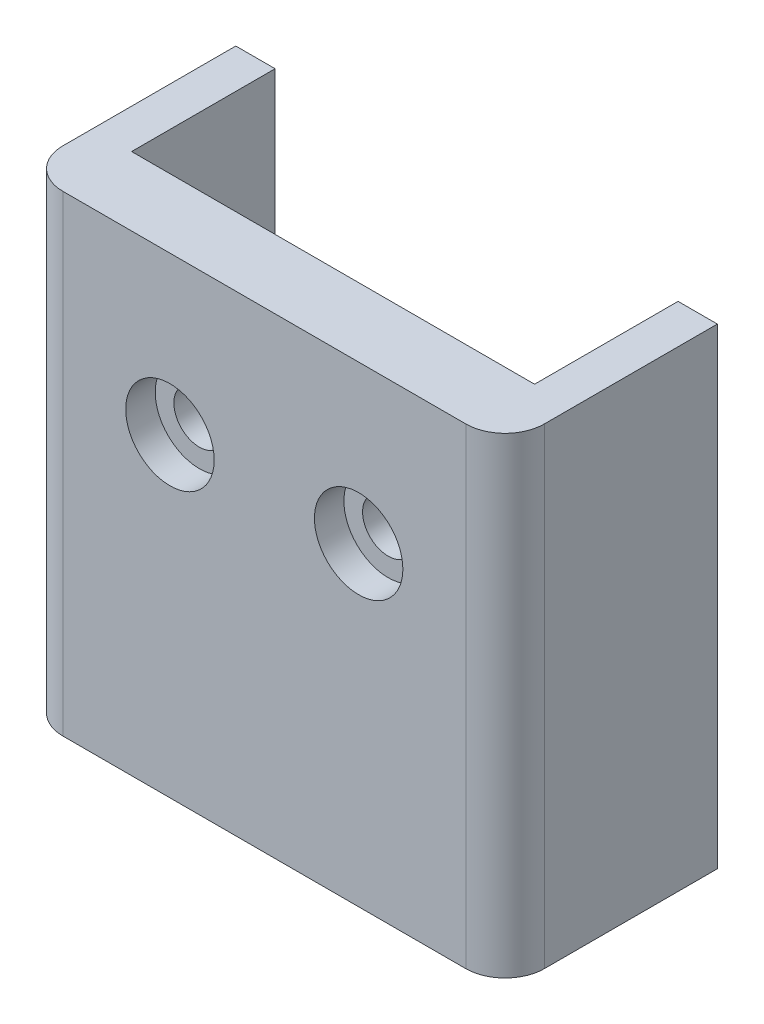
ISO-10303-21;
HEADER;
FILE_DESCRIPTION(('STEP AP214'),'2;1');
FILE_NAME('part.step','',(''),(''),'','','');
FILE_SCHEMA(('AUTOMOTIVE_DESIGN { 1 0 10303 214 1 1 1 1 }'));
ENDSEC;
DATA;
#1=APPLICATION_CONTEXT('core data for automotive mechanical design processes');
#2=APPLICATION_PROTOCOL_DEFINITION('international standard','automotive_design',2000,#1);
#3=PRODUCT_CONTEXT('',#1,'mechanical');
#4=PRODUCT('Part','Part','',(#3));
#5=PRODUCT_RELATED_PRODUCT_CATEGORY('part','',(#4));
#6=PRODUCT_DEFINITION_FORMATION('','',#4);
#7=PRODUCT_DEFINITION_CONTEXT('part definition',#1,'design');
#8=PRODUCT_DEFINITION('design','',#6,#7);
#9=PRODUCT_DEFINITION_SHAPE('','',#8);
#10=(LENGTH_UNIT() NAMED_UNIT(*) SI_UNIT(.MILLI.,.METRE.));
#11=(NAMED_UNIT(*) PLANE_ANGLE_UNIT() SI_UNIT($,.RADIAN.));
#12=(NAMED_UNIT(*) SI_UNIT($,.STERADIAN.) SOLID_ANGLE_UNIT());
#13=UNCERTAINTY_MEASURE_WITH_UNIT(LENGTH_MEASURE(1.E-05),#10,'distance_accuracy_value','');
#14=(GEOMETRIC_REPRESENTATION_CONTEXT(3) GLOBAL_UNCERTAINTY_ASSIGNED_CONTEXT((#13)) GLOBAL_UNIT_ASSIGNED_CONTEXT((#10,
#11,#12)) REPRESENTATION_CONTEXT('',''));
#15=CARTESIAN_POINT('',(0.,0.,0.));
#16=DIRECTION('',(0.,0.,1.));
#17=DIRECTION('',(1.,0.,0.));
#18=AXIS2_PLACEMENT_3D('',#15,#16,#17);
#19=CARTESIAN_POINT('',(0.,0.,0.));
#20=DIRECTION('',(0.,0.,1.));
#21=DIRECTION('',(1.,0.,0.));
#22=AXIS2_PLACEMENT_3D('',#19,#20,#21);
#23=PLANE('',#22);
#24=CARTESIAN_POINT('',(4.8,5.,0.));
#25=DIRECTION('',(0.,0.,1.));
#26=DIRECTION('',(1.,0.,0.));
#27=AXIS2_PLACEMENT_3D('',#24,#25,#26);
#28=CIRCLE('',#27,1.3);
#29=CARTESIAN_POINT('',(6.1,5.,0.));
#30=VERTEX_POINT('',#29);
#31=EDGE_CURVE('E277',#30,#30,#28,.T.);
#32=ORIENTED_EDGE('',*,*,#31,.T.);
#33=EDGE_LOOP('',(#32));
#34=FACE_BOUND('',#33,.T.);
#35=CARTESIAN_POINT('',(-4.8,5.,0.));
#36=DIRECTION('',(0.,0.,1.));
#37=DIRECTION('',(1.,0.,0.));
#38=AXIS2_PLACEMENT_3D('',#35,#36,#37);
#39=CIRCLE('',#38,1.3);
#40=CARTESIAN_POINT('',(-3.5,5.,0.));
#41=VERTEX_POINT('',#40);
#42=EDGE_CURVE('E282',#41,#41,#39,.T.);
#43=ORIENTED_EDGE('',*,*,#42,.T.);
#44=EDGE_LOOP('',(#43));
#45=FACE_BOUND('',#44,.T.);
#46=DIRECTION('',(0.,1.,0.));
#47=VECTOR('',#46,1.);
#48=CARTESIAN_POINT('',(10.25,13.,0.));
#49=LINE('',#48,#47);
#50=CARTESIAN_POINT('',(10.25,-9.,0.));
#51=VERTEX_POINT('',#50);
#52=CARTESIAN_POINT('',(10.25,13.,0.));
#53=VERTEX_POINT('',#52);
#54=EDGE_CURVE('E296',#51,#53,#49,.T.);
#55=ORIENTED_EDGE('',*,*,#54,.F.);
#56=DIRECTION('',(-1.,0.,0.));
#57=VECTOR('',#56,1.);
#58=CARTESIAN_POINT('',(-10.25,-9.,0.));
#59=LINE('',#58,#57);
#60=CARTESIAN_POINT('',(-10.25,-9.,0.));
#61=VERTEX_POINT('',#60);
#62=EDGE_CURVE('E260',#51,#61,#59,.T.);
#63=ORIENTED_EDGE('',*,*,#62,.T.);
#64=DIRECTION('',(0.,-1.,0.));
#65=VECTOR('',#64,1.);
#66=CARTESIAN_POINT('',(-10.25,13.,0.));
#67=LINE('',#66,#65);
#68=CARTESIAN_POINT('',(-10.25,13.,0.));
#69=VERTEX_POINT('',#68);
#70=EDGE_CURVE('E285',#69,#61,#67,.T.);
#71=ORIENTED_EDGE('',*,*,#70,.F.);
#72=DIRECTION('',(-1.,0.,0.));
#73=VECTOR('',#72,1.);
#74=CARTESIAN_POINT('',(-10.25,13.,0.));
#75=LINE('',#74,#73);
#76=EDGE_CURVE('E290',#53,#69,#75,.T.);
#77=ORIENTED_EDGE('',*,*,#76,.F.);
#78=EDGE_LOOP('',(#55,#63,#71,#77));
#79=FACE_BOUND('',#78,.T.);
#80=ADVANCED_FACE('F32',(#34,#45,#79),#23,.F.);
#81=CARTESIAN_POINT('',(-4.8,5.,3.5));
#82=DIRECTION('',(0.,0.,-1.));
#83=DIRECTION('',(-1.,0.,0.));
#84=AXIS2_PLACEMENT_3D('',#81,#82,#83);
#85=CYLINDRICAL_SURFACE('',#84,1.3);
#86=ORIENTED_EDGE('',*,*,#42,.F.);
#87=EDGE_LOOP('',(#86));
#88=FACE_BOUND('',#87,.T.);
#89=CARTESIAN_POINT('',(-4.8,5.,2.));
#90=DIRECTION('',(0.,0.,1.));
#91=DIRECTION('',(1.,0.,0.));
#92=AXIS2_PLACEMENT_3D('',#89,#90,#91);
#93=CIRCLE('',#92,1.3);
#94=CARTESIAN_POINT('',(-3.5,5.,2.));
#95=VERTEX_POINT('',#94);
#96=EDGE_CURVE('E253',#95,#95,#93,.T.);
#97=ORIENTED_EDGE('',*,*,#96,.T.);
#98=EDGE_LOOP('',(#97));
#99=FACE_BOUND('',#98,.T.);
#100=ADVANCED_FACE('F335',(#88,#99),#85,.F.);
#101=CARTESIAN_POINT('',(4.8,5.,3.5));
#102=DIRECTION('',(0.,0.,-1.));
#103=DIRECTION('',(-1.,0.,0.));
#104=AXIS2_PLACEMENT_3D('',#101,#102,#103);
#105=CYLINDRICAL_SURFACE('',#104,1.3);
#106=ORIENTED_EDGE('',*,*,#31,.F.);
#107=EDGE_LOOP('',(#106));
#108=FACE_BOUND('',#107,.T.);
#109=CARTESIAN_POINT('',(4.8,5.,2.));
#110=DIRECTION('',(0.,0.,1.));
#111=DIRECTION('',(1.,0.,0.));
#112=AXIS2_PLACEMENT_3D('',#109,#110,#111);
#113=CIRCLE('',#112,1.3);
#114=CARTESIAN_POINT('',(6.1,5.,2.));
#115=VERTEX_POINT('',#114);
#116=EDGE_CURVE('E234',#115,#115,#113,.T.);
#117=ORIENTED_EDGE('',*,*,#116,.T.);
#118=EDGE_LOOP('',(#117));
#119=FACE_BOUND('',#118,.T.);
#120=ADVANCED_FACE('F355',(#108,#119),#105,.F.);
#121=CARTESIAN_POINT('',(0.,0.,3.5));
#122=DIRECTION('',(0.,0.,1.));
#123=DIRECTION('',(1.,0.,0.));
#124=AXIS2_PLACEMENT_3D('',#121,#122,#123);
#125=PLANE('',#124);
#126=CARTESIAN_POINT('',(-4.8,5.,3.5));
#127=DIRECTION('',(0.,0.,1.));
#128=DIRECTION('',(1.,0.,0.));
#129=AXIS2_PLACEMENT_3D('',#126,#127,#128);
#130=CIRCLE('',#129,2.25);
#131=CARTESIAN_POINT('',(-2.55,5.,3.5));
#132=VERTEX_POINT('',#131);
#133=EDGE_CURVE('E235',#132,#132,#130,.T.);
#134=ORIENTED_EDGE('',*,*,#133,.F.);
#135=EDGE_LOOP('',(#134));
#136=FACE_BOUND('',#135,.T.);
#137=CARTESIAN_POINT('',(4.8,5.,3.5));
#138=DIRECTION('',(0.,0.,1.));
#139=DIRECTION('',(1.,0.,0.));
#140=AXIS2_PLACEMENT_3D('',#137,#138,#139);
#141=CIRCLE('',#140,2.25);
#142=CARTESIAN_POINT('',(7.05,5.,3.5));
#143=VERTEX_POINT('',#142);
#144=EDGE_CURVE('E230',#143,#143,#141,.T.);
#145=ORIENTED_EDGE('',*,*,#144,.F.);
#146=EDGE_LOOP('',(#145));
#147=FACE_BOUND('',#146,.T.);
#148=DIRECTION('',(-1.,0.,0.));
#149=VECTOR('',#148,1.);
#150=CARTESIAN_POINT('',(-10.25,13.,3.5));
#151=LINE('',#150,#149);
#152=CARTESIAN_POINT('',(10.25,13.,3.5));
#153=VERTEX_POINT('',#152);
#154=CARTESIAN_POINT('',(-10.25,13.,3.5));
#155=VERTEX_POINT('',#154);
#156=EDGE_CURVE('E289',#153,#155,#151,.T.);
#157=ORIENTED_EDGE('',*,*,#156,.T.);
#158=DIRECTION('',(0.,-1.,0.));
#159=VECTOR('',#158,1.);
#160=CARTESIAN_POINT('',(-10.25,0.,3.5));
#161=LINE('',#160,#159);
#162=CARTESIAN_POINT('',(-10.25,-11.,3.5));
#163=VERTEX_POINT('',#162);
#164=EDGE_CURVE('E315',#155,#163,#161,.T.);
#165=ORIENTED_EDGE('',*,*,#164,.T.);
#166=DIRECTION('',(1.,0.,0.));
#167=VECTOR('',#166,1.);
#168=CARTESIAN_POINT('',(-10.25,-11.,3.5));
#169=LINE('',#168,#167);
#170=CARTESIAN_POINT('',(10.25,-11.,3.5));
#171=VERTEX_POINT('',#170);
#172=EDGE_CURVE('E286',#163,#171,#169,.T.);
#173=ORIENTED_EDGE('',*,*,#172,.T.);
#174=DIRECTION('',(0.,-1.,0.));
#175=VECTOR('',#174,1.);
#176=CARTESIAN_POINT('',(10.25,0.,3.5));
#177=LINE('',#176,#175);
#178=EDGE_CURVE('E313',#171,#153,#177,.F.);
#179=ORIENTED_EDGE('',*,*,#178,.T.);
#180=EDGE_LOOP('',(#157,#165,#173,#179));
#181=FACE_BOUND('',#180,.T.);
#182=ADVANCED_FACE('F351',(#136,#147,#181),#125,.T.);
#183=CARTESIAN_POINT('',(-10.25,-11.,3.5));
#184=DIRECTION('',(0.,1.,0.));
#185=DIRECTION('',(-1.,0.,0.));
#186=AXIS2_PLACEMENT_3D('',#183,#184,#185);
#187=PLANE('',#186);
#188=CARTESIAN_POINT('',(0.,-11.,-3.50329288344196));
#189=DIRECTION('',(0.,-1.,0.));
#190=DIRECTION('',(-1.,0.,0.));
#191=AXIS2_PLACEMENT_3D('',#188,#189,#190);
#192=CIRCLE('',#191,3.74990044459615);
#193=CARTESIAN_POINT('',(3.74639242810852,-11.,-3.34112901880652));
#194=VERTEX_POINT('',#193);
#195=CARTESIAN_POINT('',(-3.74639242810852,-11.,-3.34112901880652));
#196=VERTEX_POINT('',#195);
#197=EDGE_CURVE('E188',#194,#196,#192,.T.);
#198=ORIENTED_EDGE('',*,*,#197,.F.);
#199=CARTESIAN_POINT('',(0.25,-11.,-3.5));
#200=DIRECTION('',(0.,1.,0.));
#201=DIRECTION('',(-1.,0.,0.));
#202=AXIS2_PLACEMENT_3D('',#199,#200,#201);
#203=CIRCLE('',#202,3.5);
#204=CARTESIAN_POINT('',(3.75,-11.,-3.5));
#205=VERTEX_POINT('',#204);
#206=EDGE_CURVE('E304',#194,#205,#203,.T.);
#207=ORIENTED_EDGE('',*,*,#206,.T.);
#208=DIRECTION('',(0.,0.,-1.));
#209=VECTOR('',#208,1.);
#210=CARTESIAN_POINT('',(3.75,-11.,0.));
#211=LINE('',#210,#209);
#212=CARTESIAN_POINT('',(3.75,-11.,-7.3));
#213=VERTEX_POINT('',#212);
#214=EDGE_CURVE('E247',#205,#213,#211,.T.);
#215=ORIENTED_EDGE('',*,*,#214,.T.);
#216=DIRECTION('',(1.,0.,0.));
#217=VECTOR('',#216,1.);
#218=CARTESIAN_POINT('',(12.25,-11.,-7.3));
#219=LINE('',#218,#217);
#220=CARTESIAN_POINT('',(12.25,-11.,-7.3));
#221=VERTEX_POINT('',#220);
#222=EDGE_CURVE('E215',#213,#221,#219,.T.);
#223=ORIENTED_EDGE('',*,*,#222,.T.);
#224=DIRECTION('',(0.,0.,1.));
#225=VECTOR('',#224,1.);
#226=CARTESIAN_POINT('',(12.25,-11.,3.5));
#227=LINE('',#226,#225);
#228=CARTESIAN_POINT('',(12.25,-11.,1.5));
#229=VERTEX_POINT('',#228);
#230=EDGE_CURVE('E263',#221,#229,#227,.T.);
#231=ORIENTED_EDGE('',*,*,#230,.T.);
#232=CARTESIAN_POINT('',(10.25,-11.,1.5));
#233=DIRECTION('',(0.,1.,0.));
#234=DIRECTION('',(-1.,0.,0.));
#235=AXIS2_PLACEMENT_3D('',#232,#233,#234);
#236=CIRCLE('',#235,2.);
#237=EDGE_CURVE('E318',#229,#171,#236,.F.);
#238=ORIENTED_EDGE('',*,*,#237,.T.);
#239=ORIENTED_EDGE('',*,*,#172,.F.);
#240=CARTESIAN_POINT('',(-10.25,-11.,1.5));
#241=DIRECTION('',(0.,1.,0.));
#242=DIRECTION('',(-1.,0.,0.));
#243=AXIS2_PLACEMENT_3D('',#240,#241,#242);
#244=CIRCLE('',#243,2.);
#245=CARTESIAN_POINT('',(-12.25,-11.,1.5));
#246=VERTEX_POINT('',#245);
#247=EDGE_CURVE('E320',#163,#246,#244,.F.);
#248=ORIENTED_EDGE('',*,*,#247,.T.);
#249=DIRECTION('',(0.,0.,-1.));
#250=VECTOR('',#249,1.);
#251=CARTESIAN_POINT('',(-12.25,-11.,3.5));
#252=LINE('',#251,#250);
#253=CARTESIAN_POINT('',(-12.25,-11.,-7.3));
#254=VERTEX_POINT('',#253);
#255=EDGE_CURVE('E270',#246,#254,#252,.T.);
#256=ORIENTED_EDGE('',*,*,#255,.T.);
#257=CARTESIAN_POINT('',(-3.75,-11.,-7.3));
#258=VERTEX_POINT('',#257);
#259=EDGE_CURVE('E211',#254,#258,#219,.T.);
#260=ORIENTED_EDGE('',*,*,#259,.T.);
#261=DIRECTION('',(0.,0.,1.));
#262=VECTOR('',#261,1.);
#263=CARTESIAN_POINT('',(-3.75,-11.,0.));
#264=LINE('',#263,#262);
#265=CARTESIAN_POINT('',(-3.75,-11.,-3.5));
#266=VERTEX_POINT('',#265);
#267=EDGE_CURVE('E250',#258,#266,#264,.T.);
#268=ORIENTED_EDGE('',*,*,#267,.T.);
#269=CARTESIAN_POINT('',(-0.249999999999997,-11.,-3.5));
#270=DIRECTION('',(0.,1.,0.));
#271=DIRECTION('',(-1.,0.,0.));
#272=AXIS2_PLACEMENT_3D('',#269,#270,#271);
#273=CIRCLE('',#272,3.5);
#274=EDGE_CURVE('E309',#266,#196,#273,.T.);
#275=ORIENTED_EDGE('',*,*,#274,.T.);
#276=EDGE_LOOP('',(#198,#207,#215,#223,#231,#238,#239,#248,#256,#260,#268,#275));
#277=FACE_BOUND('',#276,.T.);
#278=ADVANCED_FACE('F354',(#277),#187,.F.);
#279=CARTESIAN_POINT('',(-10.25,13.,3.5));
#280=DIRECTION('',(0.,-1.,0.));
#281=DIRECTION('',(0.,0.,-1.));
#282=AXIS2_PLACEMENT_3D('',#279,#280,#281);
#283=PLANE('',#282);
#284=DIRECTION('',(0.,0.,1.));
#285=VECTOR('',#284,1.);
#286=CARTESIAN_POINT('',(12.25,13.,3.5));
#287=LINE('',#286,#285);
#288=CARTESIAN_POINT('',(12.25,13.,-7.3));
#289=VERTEX_POINT('',#288);
#290=CARTESIAN_POINT('',(12.25,13.,1.5));
#291=VERTEX_POINT('',#290);
#292=EDGE_CURVE('E268',#289,#291,#287,.T.);
#293=ORIENTED_EDGE('',*,*,#292,.F.);
#294=DIRECTION('',(1.,0.,0.));
#295=VECTOR('',#294,1.);
#296=CARTESIAN_POINT('',(12.25,13.,-7.3));
#297=LINE('',#296,#295);
#298=CARTESIAN_POINT('',(10.25,13.,-7.3));
#299=VERTEX_POINT('',#298);
#300=EDGE_CURVE('E206',#299,#289,#297,.T.);
#301=ORIENTED_EDGE('',*,*,#300,.F.);
#302=DIRECTION('',(0.,0.,-1.));
#303=VECTOR('',#302,1.);
#304=CARTESIAN_POINT('',(10.25,13.,3.5));
#305=LINE('',#304,#303);
#306=EDGE_CURVE('E265',#53,#299,#305,.T.);
#307=ORIENTED_EDGE('',*,*,#306,.F.);
#308=ORIENTED_EDGE('',*,*,#76,.T.);
#309=DIRECTION('',(0.,0.,1.));
#310=VECTOR('',#309,1.);
#311=CARTESIAN_POINT('',(-10.25,13.,3.5));
#312=LINE('',#311,#310);
#313=CARTESIAN_POINT('',(-10.25,13.,-7.3));
#314=VERTEX_POINT('',#313);
#315=EDGE_CURVE('E272',#314,#69,#312,.T.);
#316=ORIENTED_EDGE('',*,*,#315,.F.);
#317=CARTESIAN_POINT('',(-12.25,13.,-7.3));
#318=VERTEX_POINT('',#317);
#319=EDGE_CURVE('E216',#318,#314,#297,.T.);
#320=ORIENTED_EDGE('',*,*,#319,.F.);
#321=DIRECTION('',(0.,0.,-1.));
#322=VECTOR('',#321,1.);
#323=CARTESIAN_POINT('',(-12.25,13.,3.5));
#324=LINE('',#323,#322);
#325=CARTESIAN_POINT('',(-12.25,13.,1.5));
#326=VERTEX_POINT('',#325);
#327=EDGE_CURVE('E274',#326,#318,#324,.T.);
#328=ORIENTED_EDGE('',*,*,#327,.F.);
#329=CARTESIAN_POINT('',(-10.25,13.,1.5));
#330=DIRECTION('',(0.,-1.,0.));
#331=DIRECTION('',(0.,0.,-1.));
#332=AXIS2_PLACEMENT_3D('',#329,#330,#331);
#333=CIRCLE('',#332,2.);
#334=EDGE_CURVE('E327',#326,#155,#333,.F.);
#335=ORIENTED_EDGE('',*,*,#334,.T.);
#336=ORIENTED_EDGE('',*,*,#156,.F.);
#337=CARTESIAN_POINT('',(10.25,13.,1.5));
#338=DIRECTION('',(0.,-1.,0.));
#339=DIRECTION('',(0.,0.,-1.));
#340=AXIS2_PLACEMENT_3D('',#337,#338,#339);
#341=CIRCLE('',#340,2.);
#342=EDGE_CURVE('E324',#153,#291,#341,.F.);
#343=ORIENTED_EDGE('',*,*,#342,.T.);
#344=EDGE_LOOP('',(#293,#301,#307,#308,#316,#320,#328,#335,#336,#343));
#345=FACE_BOUND('',#344,.T.);
#346=ADVANCED_FACE('F379',(#345),#283,.F.);
#347=CARTESIAN_POINT('',(-10.25,13.,3.5));
#348=DIRECTION('',(1.,0.,0.));
#349=DIRECTION('',(0.,0.,-1.));
#350=AXIS2_PLACEMENT_3D('',#347,#348,#349);
#351=PLANE('',#350);
#352=DIRECTION('',(0.,-1.,0.));
#353=VECTOR('',#352,1.);
#354=CARTESIAN_POINT('',(-10.25,13.,-7.3));
#355=LINE('',#354,#353);
#356=CARTESIAN_POINT('',(-10.25,-9.,-7.3));
#357=VERTEX_POINT('',#356);
#358=EDGE_CURVE('E47',#314,#357,#355,.T.);
#359=ORIENTED_EDGE('',*,*,#358,.F.);
#360=ORIENTED_EDGE('',*,*,#315,.T.);
#361=ORIENTED_EDGE('',*,*,#70,.T.);
#362=DIRECTION('',(0.,0.,-1.));
#363=VECTOR('',#362,1.);
#364=CARTESIAN_POINT('',(-10.25,-9.,0.));
#365=LINE('',#364,#363);
#366=EDGE_CURVE('E254',#61,#357,#365,.T.);
#367=ORIENTED_EDGE('',*,*,#366,.T.);
#368=EDGE_LOOP('',(#359,#360,#361,#367));
#369=FACE_BOUND('',#368,.T.);
#370=ADVANCED_FACE('F384',(#369),#351,.T.);
#371=CARTESIAN_POINT('',(-12.25,13.,3.5));
#372=DIRECTION('',(-1.,0.,0.));
#373=DIRECTION('',(0.,0.,1.));
#374=AXIS2_PLACEMENT_3D('',#371,#372,#373);
#375=PLANE('',#374);
#376=DIRECTION('',(0.,1.,0.));
#377=VECTOR('',#376,1.);
#378=CARTESIAN_POINT('',(-12.25,-11.,-7.3));
#379=LINE('',#378,#377);
#380=EDGE_CURVE('E214',#254,#318,#379,.T.);
#381=ORIENTED_EDGE('',*,*,#380,.F.);
#382=ORIENTED_EDGE('',*,*,#255,.F.);
#383=DIRECTION('',(0.,-1.,0.));
#384=VECTOR('',#383,1.);
#385=CARTESIAN_POINT('',(-12.25,13.,1.5));
#386=LINE('',#385,#384);
#387=EDGE_CURVE('E322',#246,#326,#386,.F.);
#388=ORIENTED_EDGE('',*,*,#387,.T.);
#389=ORIENTED_EDGE('',*,*,#327,.T.);
#390=EDGE_LOOP('',(#381,#382,#388,#389));
#391=FACE_BOUND('',#390,.T.);
#392=ADVANCED_FACE('F373',(#391),#375,.T.);
#393=CARTESIAN_POINT('',(10.25,13.,3.5));
#394=DIRECTION('',(-1.,0.,0.));
#395=DIRECTION('',(0.,0.,1.));
#396=AXIS2_PLACEMENT_3D('',#393,#394,#395);
#397=PLANE('',#396);
#398=DIRECTION('',(0.,1.,0.));
#399=VECTOR('',#398,1.);
#400=CARTESIAN_POINT('',(10.25,13.,-7.3));
#401=LINE('',#400,#399);
#402=CARTESIAN_POINT('',(10.25,-9.,-7.3));
#403=VERTEX_POINT('',#402);
#404=EDGE_CURVE('E223',#403,#299,#401,.T.);
#405=ORIENTED_EDGE('',*,*,#404,.F.);
#406=DIRECTION('',(0.,0.,1.));
#407=VECTOR('',#406,1.);
#408=CARTESIAN_POINT('',(10.25,-9.,0.));
#409=LINE('',#408,#407);
#410=EDGE_CURVE('E243',#403,#51,#409,.T.);
#411=ORIENTED_EDGE('',*,*,#410,.T.);
#412=ORIENTED_EDGE('',*,*,#54,.T.);
#413=ORIENTED_EDGE('',*,*,#306,.T.);
#414=EDGE_LOOP('',(#405,#411,#412,#413));
#415=FACE_BOUND('',#414,.T.);
#416=ADVANCED_FACE('F393',(#415),#397,.T.);
#417=CARTESIAN_POINT('',(12.25,13.,3.5));
#418=DIRECTION('',(1.,0.,0.));
#419=DIRECTION('',(0.,0.,-1.));
#420=AXIS2_PLACEMENT_3D('',#417,#418,#419);
#421=PLANE('',#420);
#422=DIRECTION('',(0.,1.,0.));
#423=VECTOR('',#422,1.);
#424=CARTESIAN_POINT('',(12.25,-11.,-7.3));
#425=LINE('',#424,#423);
#426=EDGE_CURVE('E218',#221,#289,#425,.T.);
#427=ORIENTED_EDGE('',*,*,#426,.T.);
#428=ORIENTED_EDGE('',*,*,#292,.T.);
#429=DIRECTION('',(0.,-1.,0.));
#430=VECTOR('',#429,1.);
#431=CARTESIAN_POINT('',(12.25,13.,1.5));
#432=LINE('',#431,#430);
#433=EDGE_CURVE('E40',#291,#229,#432,.T.);
#434=ORIENTED_EDGE('',*,*,#433,.T.);
#435=ORIENTED_EDGE('',*,*,#230,.F.);
#436=EDGE_LOOP('',(#427,#428,#434,#435));
#437=FACE_BOUND('',#436,.T.);
#438=ADVANCED_FACE('F420',(#437),#421,.T.);
#439=CARTESIAN_POINT('',(-3.75,-9.,0.));
#440=DIRECTION('',(1.,0.,0.));
#441=DIRECTION('',(0.,0.,-1.));
#442=AXIS2_PLACEMENT_3D('',#439,#440,#441);
#443=PLANE('',#442);
#444=DIRECTION('',(0.,-1.,0.));
#445=VECTOR('',#444,1.);
#446=CARTESIAN_POINT('',(-3.75,-9.,-7.3));
#447=LINE('',#446,#445);
#448=CARTESIAN_POINT('',(-3.75,-9.,-7.3));
#449=VERTEX_POINT('',#448);
#450=EDGE_CURVE('E227',#449,#258,#447,.T.);
#451=ORIENTED_EDGE('',*,*,#450,.F.);
#452=DIRECTION('',(0.,0.,1.));
#453=VECTOR('',#452,1.);
#454=CARTESIAN_POINT('',(-3.75,-9.,0.));
#455=LINE('',#454,#453);
#456=CARTESIAN_POINT('',(-3.75,-9.,-3.5));
#457=VERTEX_POINT('',#456);
#458=EDGE_CURVE('E257',#449,#457,#455,.T.);
#459=ORIENTED_EDGE('',*,*,#458,.T.);
#460=DIRECTION('',(0.,-1.,0.));
#461=VECTOR('',#460,1.);
#462=CARTESIAN_POINT('',(-3.75,-9.,-3.5));
#463=LINE('',#462,#461);
#464=EDGE_CURVE('E301',#457,#266,#463,.T.);
#465=ORIENTED_EDGE('',*,*,#464,.T.);
#466=ORIENTED_EDGE('',*,*,#267,.F.);
#467=EDGE_LOOP('',(#451,#459,#465,#466));
#468=FACE_BOUND('',#467,.T.);
#469=ADVANCED_FACE('F418',(#468),#443,.T.);
#470=CARTESIAN_POINT('',(0.,-9.,0.));
#471=DIRECTION('',(0.,-1.,0.));
#472=DIRECTION('',(0.,0.,-1.));
#473=AXIS2_PLACEMENT_3D('',#470,#471,#472);
#474=PLANE('',#473);
#475=ORIENTED_EDGE('',*,*,#458,.F.);
#476=DIRECTION('',(-1.,0.,0.));
#477=VECTOR('',#476,1.);
#478=CARTESIAN_POINT('',(0.,-9.,-7.3));
#479=LINE('',#478,#477);
#480=EDGE_CURVE('E225',#449,#357,#479,.T.);
#481=ORIENTED_EDGE('',*,*,#480,.T.);
#482=ORIENTED_EDGE('',*,*,#366,.F.);
#483=ORIENTED_EDGE('',*,*,#62,.F.);
#484=ORIENTED_EDGE('',*,*,#410,.F.);
#485=DIRECTION('',(1.,0.,0.));
#486=VECTOR('',#485,1.);
#487=CARTESIAN_POINT('',(0.,-9.,-7.3));
#488=LINE('',#487,#486);
#489=CARTESIAN_POINT('',(3.75,-9.,-7.3));
#490=VERTEX_POINT('',#489);
#491=EDGE_CURVE('E11',#490,#403,#488,.T.);
#492=ORIENTED_EDGE('',*,*,#491,.F.);
#493=DIRECTION('',(0.,0.,-1.));
#494=VECTOR('',#493,1.);
#495=CARTESIAN_POINT('',(3.75,-9.,0.));
#496=LINE('',#495,#494);
#497=CARTESIAN_POINT('',(3.75,-9.,-3.5));
#498=VERTEX_POINT('',#497);
#499=EDGE_CURVE('E246',#498,#490,#496,.T.);
#500=ORIENTED_EDGE('',*,*,#499,.F.);
#501=CARTESIAN_POINT('',(0.25,-9.,-3.5));
#502=DIRECTION('',(0.,1.,0.));
#503=DIRECTION('',(0.,0.,1.));
#504=AXIS2_PLACEMENT_3D('',#501,#502,#503);
#505=CIRCLE('',#504,3.5);
#506=CARTESIAN_POINT('',(3.74639242810852,-9.,-3.34112901880652));
#507=VERTEX_POINT('',#506);
#508=EDGE_CURVE('E306',#498,#507,#505,.F.);
#509=ORIENTED_EDGE('',*,*,#508,.T.);
#510=DIRECTION('',(1.,0.,0.));
#511=VECTOR('',#510,1.);
#512=CARTESIAN_POINT('',(1.94830294173751,-9.,-3.34112901880652));
#513=LINE('',#512,#511);
#514=CARTESIAN_POINT('',(1.94830294173751,-9.,-3.34112901880652));
#515=VERTEX_POINT('',#514);
#516=EDGE_CURVE('E203',#515,#507,#513,.T.);
#517=ORIENTED_EDGE('',*,*,#516,.F.);
#518=CARTESIAN_POINT('',(0.,-9.,-3.50000000000001));
#519=DIRECTION('',(0.,1.,0.));
#520=DIRECTION('',(-1.,0.,0.));
#521=AXIS2_PLACEMENT_3D('',#518,#519,#520);
#522=CIRCLE('',#521,1.95476963897243);
#523=CARTESIAN_POINT('',(-1.9483029417375,-9.,-3.34112901880652));
#524=VERTEX_POINT('',#523);
#525=EDGE_CURVE('E168',#524,#515,#522,.T.);
#526=ORIENTED_EDGE('',*,*,#525,.F.);
#527=DIRECTION('',(1.,0.,0.));
#528=VECTOR('',#527,1.);
#529=CARTESIAN_POINT('',(-3.74639242810852,-9.,-3.34112901880652));
#530=LINE('',#529,#528);
#531=CARTESIAN_POINT('',(-3.74639242810852,-9.,-3.34112901880652));
#532=VERTEX_POINT('',#531);
#533=EDGE_CURVE('E199',#532,#524,#530,.T.);
#534=ORIENTED_EDGE('',*,*,#533,.F.);
#535=CARTESIAN_POINT('',(-0.249999999999997,-9.,-3.5));
#536=DIRECTION('',(0.,-1.,0.));
#537=DIRECTION('',(0.,0.,-1.));
#538=AXIS2_PLACEMENT_3D('',#535,#536,#537);
#539=CIRCLE('',#538,3.5);
#540=EDGE_CURVE('E311',#532,#457,#539,.T.);
#541=ORIENTED_EDGE('',*,*,#540,.T.);
#542=EDGE_LOOP('',(#475,#481,#482,#483,#484,#492,#500,#509,#517,#526,#534,#541));
#543=FACE_BOUND('',#542,.T.);
#544=ADVANCED_FACE('F387',(#543),#474,.F.);
#545=CARTESIAN_POINT('',(3.75,-9.,0.));
#546=DIRECTION('',(-1.,0.,0.));
#547=DIRECTION('',(0.,0.,1.));
#548=AXIS2_PLACEMENT_3D('',#545,#546,#547);
#549=PLANE('',#548);
#550=DIRECTION('',(0.,1.,0.));
#551=VECTOR('',#550,1.);
#552=CARTESIAN_POINT('',(3.75,-9.,-7.3));
#553=LINE('',#552,#551);
#554=EDGE_CURVE('E54',#213,#490,#553,.T.);
#555=ORIENTED_EDGE('',*,*,#554,.F.);
#556=ORIENTED_EDGE('',*,*,#214,.F.);
#557=DIRECTION('',(0.,-1.,0.));
#558=VECTOR('',#557,1.);
#559=CARTESIAN_POINT('',(3.75,-9.,-3.5));
#560=LINE('',#559,#558);
#561=EDGE_CURVE('E293',#205,#498,#560,.F.);
#562=ORIENTED_EDGE('',*,*,#561,.T.);
#563=ORIENTED_EDGE('',*,*,#499,.T.);
#564=EDGE_LOOP('',(#555,#556,#562,#563));
#565=FACE_BOUND('',#564,.T.);
#566=ADVANCED_FACE('F397',(#565),#549,.T.);
#567=CARTESIAN_POINT('',(0.25,0.,-3.5));
#568=DIRECTION('',(0.,-1.,0.));
#569=DIRECTION('',(0.,0.,-1.));
#570=AXIS2_PLACEMENT_3D('',#567,#568,#569);
#571=CYLINDRICAL_SURFACE('',#570,3.5);
#572=ORIENTED_EDGE('',*,*,#206,.F.);
#573=DIRECTION('',(0.,-1.,0.));
#574=VECTOR('',#573,1.);
#575=CARTESIAN_POINT('',(3.74639242810852,-9.,-3.34112901880652));
#576=LINE('',#575,#574);
#577=EDGE_CURVE('E171',#507,#194,#576,.T.);
#578=ORIENTED_EDGE('',*,*,#577,.F.);
#579=ORIENTED_EDGE('',*,*,#508,.F.);
#580=ORIENTED_EDGE('',*,*,#561,.F.);
#581=EDGE_LOOP('',(#572,#578,#579,#580));
#582=FACE_BOUND('',#581,.T.);
#583=ADVANCED_FACE('F402',(#582),#571,.F.);
#584=CARTESIAN_POINT('',(-0.249999999999997,-9.,-3.5));
#585=DIRECTION('',(0.,-1.,0.));
#586=DIRECTION('',(0.,0.,-1.));
#587=AXIS2_PLACEMENT_3D('',#584,#585,#586);
#588=CYLINDRICAL_SURFACE('',#587,3.5);
#589=ORIENTED_EDGE('',*,*,#540,.F.);
#590=DIRECTION('',(0.,-1.,0.));
#591=VECTOR('',#590,1.);
#592=CARTESIAN_POINT('',(-3.74639242810852,-9.,-3.34112901880652));
#593=LINE('',#592,#591);
#594=EDGE_CURVE('E205',#532,#196,#593,.T.);
#595=ORIENTED_EDGE('',*,*,#594,.T.);
#596=ORIENTED_EDGE('',*,*,#274,.F.);
#597=ORIENTED_EDGE('',*,*,#464,.F.);
#598=EDGE_LOOP('',(#589,#595,#596,#597));
#599=FACE_BOUND('',#598,.T.);
#600=ADVANCED_FACE('F411',(#599),#588,.F.);
#601=CARTESIAN_POINT('',(-10.25,0.,1.5));
#602=DIRECTION('',(0.,-1.,0.));
#603=DIRECTION('',(0.,0.,-1.));
#604=AXIS2_PLACEMENT_3D('',#601,#602,#603);
#605=CYLINDRICAL_SURFACE('',#604,2.);
#606=ORIENTED_EDGE('',*,*,#334,.F.);
#607=ORIENTED_EDGE('',*,*,#387,.F.);
#608=ORIENTED_EDGE('',*,*,#247,.F.);
#609=ORIENTED_EDGE('',*,*,#164,.F.);
#610=EDGE_LOOP('',(#606,#607,#608,#609));
#611=FACE_BOUND('',#610,.T.);
#612=ADVANCED_FACE('F367',(#611),#605,.T.);
#613=CARTESIAN_POINT('',(10.25,13.,1.5));
#614=DIRECTION('',(0.,-1.,0.));
#615=DIRECTION('',(0.,0.,-1.));
#616=AXIS2_PLACEMENT_3D('',#613,#614,#615);
#617=CYLINDRICAL_SURFACE('',#616,2.);
#618=ORIENTED_EDGE('',*,*,#342,.F.);
#619=ORIENTED_EDGE('',*,*,#178,.F.);
#620=ORIENTED_EDGE('',*,*,#237,.F.);
#621=ORIENTED_EDGE('',*,*,#433,.F.);
#622=EDGE_LOOP('',(#618,#619,#620,#621));
#623=FACE_BOUND('',#622,.T.);
#624=ADVANCED_FACE('F34',(#623),#617,.T.);
#625=CARTESIAN_POINT('',(4.8,5.,2.));
#626=DIRECTION('',(0.,0.,1.));
#627=DIRECTION('',(1.,0.,0.));
#628=AXIS2_PLACEMENT_3D('',#625,#626,#627);
#629=CYLINDRICAL_SURFACE('',#628,2.25);
#630=CARTESIAN_POINT('',(4.8,5.,2.));
#631=DIRECTION('',(0.,0.,1.));
#632=DIRECTION('',(1.,0.,0.));
#633=AXIS2_PLACEMENT_3D('',#630,#631,#632);
#634=CIRCLE('',#633,2.25);
#635=CARTESIAN_POINT('',(7.05,5.,2.));
#636=VERTEX_POINT('',#635);
#637=EDGE_CURVE('E238',#636,#636,#634,.T.);
#638=ORIENTED_EDGE('',*,*,#637,.F.);
#639=EDGE_LOOP('',(#638));
#640=FACE_BOUND('',#639,.T.);
#641=ORIENTED_EDGE('',*,*,#144,.T.);
#642=EDGE_LOOP('',(#641));
#643=FACE_BOUND('',#642,.T.);
#644=ADVANCED_FACE('F450',(#640,#643),#629,.F.);
#645=CARTESIAN_POINT('',(4.8,5.,2.));
#646=DIRECTION('',(0.,0.,1.));
#647=DIRECTION('',(1.,0.,0.));
#648=AXIS2_PLACEMENT_3D('',#645,#646,#647);
#649=PLANE('',#648);
#650=ORIENTED_EDGE('',*,*,#116,.F.);
#651=EDGE_LOOP('',(#650));
#652=FACE_BOUND('',#651,.T.);
#653=ORIENTED_EDGE('',*,*,#637,.T.);
#654=EDGE_LOOP('',(#653));
#655=FACE_BOUND('',#654,.T.);
#656=ADVANCED_FACE('F347',(#652,#655),#649,.T.);
#657=CARTESIAN_POINT('',(-4.8,5.,2.));
#658=DIRECTION('',(0.,0.,1.));
#659=DIRECTION('',(1.,0.,0.));
#660=AXIS2_PLACEMENT_3D('',#657,#658,#659);
#661=CYLINDRICAL_SURFACE('',#660,2.25);
#662=CARTESIAN_POINT('',(-4.8,5.,2.));
#663=DIRECTION('',(0.,0.,1.));
#664=DIRECTION('',(1.,0.,0.));
#665=AXIS2_PLACEMENT_3D('',#662,#663,#664);
#666=CIRCLE('',#665,2.25);
#667=CARTESIAN_POINT('',(-2.55,5.,2.));
#668=VERTEX_POINT('',#667);
#669=EDGE_CURVE('E231',#668,#668,#666,.T.);
#670=ORIENTED_EDGE('',*,*,#669,.F.);
#671=EDGE_LOOP('',(#670));
#672=FACE_BOUND('',#671,.T.);
#673=ORIENTED_EDGE('',*,*,#133,.T.);
#674=EDGE_LOOP('',(#673));
#675=FACE_BOUND('',#674,.T.);
#676=ADVANCED_FACE('F341',(#672,#675),#661,.F.);
#677=CARTESIAN_POINT('',(-4.8,5.,2.));
#678=DIRECTION('',(0.,0.,1.));
#679=DIRECTION('',(1.,0.,0.));
#680=AXIS2_PLACEMENT_3D('',#677,#678,#679);
#681=PLANE('',#680);
#682=ORIENTED_EDGE('',*,*,#96,.F.);
#683=EDGE_LOOP('',(#682));
#684=FACE_BOUND('',#683,.T.);
#685=ORIENTED_EDGE('',*,*,#669,.T.);
#686=EDGE_LOOP('',(#685));
#687=FACE_BOUND('',#686,.T.);
#688=ADVANCED_FACE('F337',(#684,#687),#681,.T.);
#689=CARTESIAN_POINT('',(12.25,-11.,-7.3));
#690=DIRECTION('',(0.,0.,1.));
#691=DIRECTION('',(1.,0.,0.));
#692=AXIS2_PLACEMENT_3D('',#689,#690,#691);
#693=PLANE('',#692);
#694=ORIENTED_EDGE('',*,*,#404,.T.);
#695=ORIENTED_EDGE('',*,*,#300,.T.);
#696=ORIENTED_EDGE('',*,*,#426,.F.);
#697=ORIENTED_EDGE('',*,*,#222,.F.);
#698=ORIENTED_EDGE('',*,*,#554,.T.);
#699=ORIENTED_EDGE('',*,*,#491,.T.);
#700=EDGE_LOOP('',(#694,#695,#696,#697,#698,#699));
#701=FACE_BOUND('',#700,.T.);
#702=ADVANCED_FACE('F340',(#701),#693,.F.);
#703=ORIENTED_EDGE('',*,*,#358,.T.);
#704=ORIENTED_EDGE('',*,*,#480,.F.);
#705=ORIENTED_EDGE('',*,*,#450,.T.);
#706=ORIENTED_EDGE('',*,*,#259,.F.);
#707=ORIENTED_EDGE('',*,*,#380,.T.);
#708=ORIENTED_EDGE('',*,*,#319,.T.);
#709=EDGE_LOOP('',(#703,#704,#705,#706,#707,#708));
#710=FACE_BOUND('',#709,.T.);
#711=ADVANCED_FACE('F376',(#710),#693,.F.);
#712=CARTESIAN_POINT('',(1.94830294173751,-9.,-3.34112901880652));
#713=DIRECTION('',(0.,0.,-1.));
#714=DIRECTION('',(-1.,0.,0.));
#715=AXIS2_PLACEMENT_3D('',#712,#713,#714);
#716=PLANE('',#715);
#717=ORIENTED_EDGE('',*,*,#577,.T.);
#718=DIRECTION('',(0.,1.,0.));
#719=VECTOR('',#718,1.);
#720=CARTESIAN_POINT('',(3.74639242810852,-13.,-3.34112901880652));
#721=LINE('',#720,#719);
#722=CARTESIAN_POINT('',(3.74639242810852,-13.,-3.34112901880652));
#723=VERTEX_POINT('',#722);
#724=EDGE_CURVE('E179',#723,#194,#721,.T.);
#725=ORIENTED_EDGE('',*,*,#724,.F.);
#726=DIRECTION('',(1.,0.,0.));
#727=VECTOR('',#726,1.);
#728=CARTESIAN_POINT('',(1.94830294173751,-13.,-3.34112901880652));
#729=LINE('',#728,#727);
#730=CARTESIAN_POINT('',(1.94830294173751,-13.,-3.34112901880652));
#731=VERTEX_POINT('',#730);
#732=EDGE_CURVE('E175',#731,#723,#729,.T.);
#733=ORIENTED_EDGE('',*,*,#732,.F.);
#734=DIRECTION('',(0.,-1.,0.));
#735=VECTOR('',#734,1.);
#736=CARTESIAN_POINT('',(1.94830294173751,-9.,-3.34112901880652));
#737=LINE('',#736,#735);
#738=EDGE_CURVE('E162',#515,#731,#737,.T.);
#739=ORIENTED_EDGE('',*,*,#738,.F.);
#740=ORIENTED_EDGE('',*,*,#516,.T.);
#741=EDGE_LOOP('',(#717,#725,#733,#739,#740));
#742=FACE_BOUND('',#741,.T.);
#743=ADVANCED_FACE('F177',(#742),#716,.T.);
#744=CARTESIAN_POINT('',(0.,-9.,-3.50000000000001));
#745=DIRECTION('',(0.,-1.,0.));
#746=DIRECTION('',(1.,0.,0.));
#747=AXIS2_PLACEMENT_3D('',#744,#745,#746);
#748=CYLINDRICAL_SURFACE('',#747,1.95476963897243);
#749=ORIENTED_EDGE('',*,*,#738,.T.);
#750=CARTESIAN_POINT('',(0.,-13.,-3.50000000000001));
#751=DIRECTION('',(0.,1.,0.));
#752=DIRECTION('',(-1.,0.,0.));
#753=AXIS2_PLACEMENT_3D('',#750,#751,#752);
#754=CIRCLE('',#753,1.95476963897243);
#755=CARTESIAN_POINT('',(-1.9483029417375,-13.,-3.34112901880652));
#756=VERTEX_POINT('',#755);
#757=EDGE_CURVE('E166',#756,#731,#754,.T.);
#758=ORIENTED_EDGE('',*,*,#757,.F.);
#759=DIRECTION('',(0.,-1.,0.));
#760=VECTOR('',#759,1.);
#761=CARTESIAN_POINT('',(-1.9483029417375,-9.,-3.34112901880652));
#762=LINE('',#761,#760);
#763=EDGE_CURVE('E172',#524,#756,#762,.T.);
#764=ORIENTED_EDGE('',*,*,#763,.F.);
#765=ORIENTED_EDGE('',*,*,#525,.T.);
#766=EDGE_LOOP('',(#749,#758,#764,#765));
#767=FACE_BOUND('',#766,.T.);
#768=ADVANCED_FACE('F164',(#767),#748,.F.);
#769=CARTESIAN_POINT('',(-3.74639242810852,-9.,-3.34112901880652));
#770=DIRECTION('',(0.,0.,-1.));
#771=DIRECTION('',(-1.,0.,0.));
#772=AXIS2_PLACEMENT_3D('',#769,#770,#771);
#773=PLANE('',#772);
#774=ORIENTED_EDGE('',*,*,#763,.T.);
#775=DIRECTION('',(1.,0.,0.));
#776=VECTOR('',#775,1.);
#777=CARTESIAN_POINT('',(-1.9483029417375,-13.,-3.34112901880652));
#778=LINE('',#777,#776);
#779=CARTESIAN_POINT('',(-3.74639242810852,-13.,-3.34112901880652));
#780=VERTEX_POINT('',#779);
#781=EDGE_CURVE('E187',#780,#756,#778,.T.);
#782=ORIENTED_EDGE('',*,*,#781,.F.);
#783=DIRECTION('',(0.,1.,0.));
#784=VECTOR('',#783,1.);
#785=CARTESIAN_POINT('',(-3.74639242810852,-13.,-3.34112901880652));
#786=LINE('',#785,#784);
#787=EDGE_CURVE('E194',#780,#196,#786,.T.);
#788=ORIENTED_EDGE('',*,*,#787,.T.);
#789=ORIENTED_EDGE('',*,*,#594,.F.);
#790=ORIENTED_EDGE('',*,*,#533,.T.);
#791=EDGE_LOOP('',(#774,#782,#788,#789,#790));
#792=FACE_BOUND('',#791,.T.);
#793=ADVANCED_FACE('F407',(#792),#773,.T.);
#794=CARTESIAN_POINT('',(0.,-13.,-3.50329288344196));
#795=DIRECTION('',(0.,1.,0.));
#796=DIRECTION('',(-1.,0.,0.));
#797=AXIS2_PLACEMENT_3D('',#794,#795,#796);
#798=CYLINDRICAL_SURFACE('',#797,3.74990044459615);
#799=ORIENTED_EDGE('',*,*,#197,.T.);
#800=ORIENTED_EDGE('',*,*,#787,.F.);
#801=CARTESIAN_POINT('',(0.,-13.,-3.50329288344196));
#802=DIRECTION('',(0.,-1.,0.));
#803=DIRECTION('',(-1.,0.,0.));
#804=AXIS2_PLACEMENT_3D('',#801,#802,#803);
#805=CIRCLE('',#804,3.74990044459615);
#806=EDGE_CURVE('E182',#723,#780,#805,.T.);
#807=ORIENTED_EDGE('',*,*,#806,.F.);
#808=ORIENTED_EDGE('',*,*,#724,.T.);
#809=EDGE_LOOP('',(#799,#800,#807,#808));
#810=FACE_BOUND('',#809,.T.);
#811=ADVANCED_FACE('F414',(#810),#798,.T.);
#812=CARTESIAN_POINT('',(0.,-13.,-3.50000000000001));
#813=DIRECTION('',(0.,1.,0.));
#814=DIRECTION('',(-1.,0.,0.));
#815=AXIS2_PLACEMENT_3D('',#812,#813,#814);
#816=PLANE('',#815);
#817=ORIENTED_EDGE('',*,*,#757,.T.);
#818=ORIENTED_EDGE('',*,*,#732,.T.);
#819=ORIENTED_EDGE('',*,*,#806,.T.);
#820=ORIENTED_EDGE('',*,*,#781,.T.);
#821=EDGE_LOOP('',(#817,#818,#819,#820));
#822=FACE_BOUND('',#821,.T.);
#823=ADVANCED_FACE('F185',(#822),#816,.F.);
#824=CLOSED_SHELL('',(#80,#100,#120,#182,#278,#346,#370,#392,#416,#438,#469,#544,#566,#583,#600,
#612,#624,#644,#656,#676,#688,#702,#711,#743,#768,#793,#811,#823));
#825=MANIFOLD_SOLID_BREP('B2',#824);
#826=ADVANCED_BREP_SHAPE_REPRESENTATION('',(#18,#825),#14);
#827=SHAPE_DEFINITION_REPRESENTATION(#9,#826);
ENDSEC;
END-ISO-10303-21;
